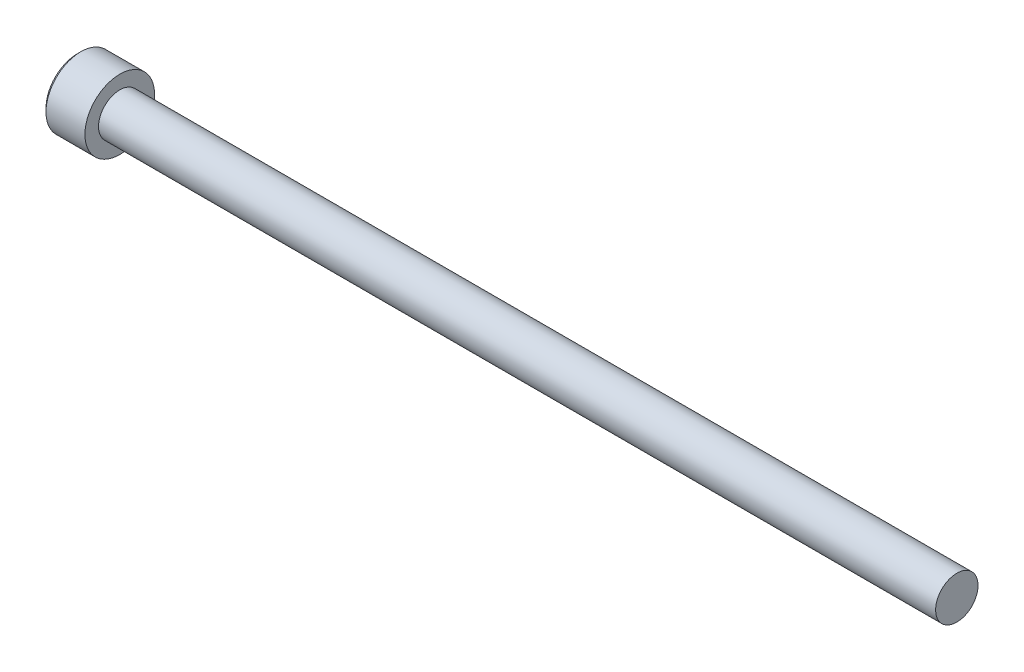
ISO-10303-21;
HEADER;
FILE_DESCRIPTION(('STEP AP214'),'2;1');
FILE_NAME('part.step','',(''),(''),'','','');
FILE_SCHEMA(('AUTOMOTIVE_DESIGN { 1 0 10303 214 1 1 1 1 }'));
ENDSEC;
DATA;
#1=APPLICATION_CONTEXT('core data for automotive mechanical design processes');
#2=APPLICATION_PROTOCOL_DEFINITION('international standard','automotive_design',2000,#1);
#3=PRODUCT_CONTEXT('',#1,'mechanical');
#4=PRODUCT('Part','Part','',(#3));
#5=PRODUCT_RELATED_PRODUCT_CATEGORY('part','',(#4));
#6=PRODUCT_DEFINITION_FORMATION('','',#4);
#7=PRODUCT_DEFINITION_CONTEXT('part definition',#1,'design');
#8=PRODUCT_DEFINITION('design','',#6,#7);
#9=PRODUCT_DEFINITION_SHAPE('','',#8);
#10=(LENGTH_UNIT() NAMED_UNIT(*) SI_UNIT(.MILLI.,.METRE.));
#11=(NAMED_UNIT(*) PLANE_ANGLE_UNIT() SI_UNIT($,.RADIAN.));
#12=(NAMED_UNIT(*) SI_UNIT($,.STERADIAN.) SOLID_ANGLE_UNIT());
#13=UNCERTAINTY_MEASURE_WITH_UNIT(LENGTH_MEASURE(1.E-05),#10,'distance_accuracy_value','');
#14=(GEOMETRIC_REPRESENTATION_CONTEXT(3) GLOBAL_UNCERTAINTY_ASSIGNED_CONTEXT((#13)) GLOBAL_UNIT_ASSIGNED_CONTEXT((#10,
#11,#12)) REPRESENTATION_CONTEXT('',''));
#15=CARTESIAN_POINT('',(0.,0.,0.));
#16=DIRECTION('',(0.,0.,1.));
#17=DIRECTION('',(1.,0.,0.));
#18=AXIS2_PLACEMENT_3D('',#15,#16,#17);
#19=CARTESIAN_POINT('',(-2.28600000000007,-1.14567944042317,1.984375));
#20=DIRECTION('',(0.,0.,1.));
#21=DIRECTION('',(1.,0.,0.));
#22=AXIS2_PLACEMENT_3D('',#19,#20,#21);
#23=PLANE('',#22);
#24=CARTESIAN_POINT('',(-4.82599999995852,1.14567944044653,1.98437499999554));
#25=CARTESIAN_POINT('',(-4.78691618362732,1.06743880343266,1.9843749999984));
#26=CARTESIAN_POINT('',(-4.75011447684892,0.987898318960917,1.98437499999957));
#27=CARTESIAN_POINT('',(-4.68265620500518,0.825677042028778,1.98437500000043));
#28=CARTESIAN_POINT('',(-4.65204056061138,0.742979382529199,1.98437500000012));
#29=CARTESIAN_POINT('',(-4.5991739228306,0.575193959555969,1.98437499999988));
#30=CARTESIAN_POINT('',(-4.57689462080725,0.490115359117279,1.98437499999997));
#31=CARTESIAN_POINT('',(-4.54259467221837,0.318093091130193,1.98437500000003));
#32=CARTESIAN_POINT('',(-4.5305423022885,0.231156054976726,1.984375));
#33=CARTESIAN_POINT('',(-4.52249110263747,0.119918521511051,1.984375));
#34=CARTESIAN_POINT('',(-4.52118947557477,0.0959468443046798,1.984375));
#35=CARTESIAN_POINT('',(-4.51945182629813,0.0479845644411998,1.984375));
#36=CARTESIAN_POINT('',(-4.51901533386223,0.0239939791589393,1.984375));
#37=CARTESIAN_POINT('',(-4.51901809008399,-0.0602201717457363,1.984375));
#38=CARTESIAN_POINT('',(-4.52177452299902,-0.120461721905447,1.984375));
#39=CARTESIAN_POINT('',(-4.5326365512493,-0.240474970989197,1.984375));
#40=CARTESIAN_POINT('',(-4.54074587749718,-0.300246312758427,1.984375));
#41=CARTESIAN_POINT('',(-4.57259622946939,-0.478763752804282,1.984375));
#42=CARTESIAN_POINT('',(-4.60385422611702,-0.596208828937734,1.984375));
#43=CARTESIAN_POINT('',(-4.66780003592237,-0.785921487441256,1.984375));
#44=CARTESIAN_POINT('',(-4.69623457768558,-0.859734609866899,1.984375));
#45=CARTESIAN_POINT('',(-4.75786140400812,-1.00456595519282,1.984375));
#46=CARTESIAN_POINT('',(-4.79100779300359,-1.07560356657101,1.984375));
#47=CARTESIAN_POINT('',(-4.82599999995643,-1.14567944044724,1.984375));
#48=B_SPLINE_CURVE_WITH_KNOTS('',3,(#24,#25,#26,#27,#28,#29,#30,#31,#32,#33,#34,#35,#36,#37,#38,
#39,#40,#41,#42,#43,#44,#45,#46,#47),.UNSPECIFIED.,.F.,.F.,(4,2,2,2,2,2,2,2,2,2,2,4),(0.,
0.262559005207405,0.526801735838036,0.790138824405318,1.05265603861765,1.12466619182083,
1.19663719499031,1.3772702672652,1.55802937209382,1.92104085090328,2.15819130092264,
2.39317265078575),.UNSPECIFIED.);
#49=CARTESIAN_POINT('',(-4.82599999996829,1.14567944041753,1.98437500003084));
#50=VERTEX_POINT('',#49);
#51=CARTESIAN_POINT('',(-4.8259999999622,-1.14567944043207,1.98437500001542));
#52=VERTEX_POINT('',#51);
#53=EDGE_CURVE('E20',#50,#52,#48,.T.);
#54=ORIENTED_EDGE('',*,*,#53,.F.);
#55=DIRECTION('',(1.,0.,0.));
#56=VECTOR('',#55,1.);
#57=CARTESIAN_POINT('',(-2.28600000000007,1.14567944042316,1.984375));
#58=LINE('',#57,#56);
#59=CARTESIAN_POINT('',(-2.28600000000007,1.14567944042316,1.984375));
#60=VERTEX_POINT('',#59);
#61=EDGE_CURVE('E68',#50,#60,#58,.T.);
#62=ORIENTED_EDGE('',*,*,#61,.T.);
#63=DIRECTION('',(0.,1.,0.));
#64=VECTOR('',#63,1.);
#65=CARTESIAN_POINT('',(-2.28600000000007,0.,1.984375));
#66=LINE('',#65,#64);
#67=CARTESIAN_POINT('',(-2.28600000000007,-1.14567944042317,1.984375));
#68=VERTEX_POINT('',#67);
#69=EDGE_CURVE('E74',#68,#60,#66,.T.);
#70=ORIENTED_EDGE('',*,*,#69,.F.);
#71=DIRECTION('',(1.,0.,0.));
#72=VECTOR('',#71,1.);
#73=CARTESIAN_POINT('',(-2.28600000000007,-1.14567944042317,1.984375));
#74=LINE('',#73,#72);
#75=EDGE_CURVE('E71',#68,#52,#74,.F.);
#76=ORIENTED_EDGE('',*,*,#75,.T.);
#77=EDGE_LOOP('',(#54,#62,#70,#76));
#78=FACE_BOUND('',#77,.T.);
#79=ADVANCED_FACE('F16',(#78),#23,.F.);
#80=CARTESIAN_POINT('',(-2.28600000000007,0.,0.));
#81=DIRECTION('',(-1.,0.,0.));
#82=DIRECTION('',(0.,0.,1.));
#83=AXIS2_PLACEMENT_3D('',#80,#81,#82);
#84=PLANE('',#83);
#85=DIRECTION('',(0.,0.5,0.866025403784439));
#86=VECTOR('',#85,1.);
#87=CARTESIAN_POINT('',(-2.28600000000007,2.29135888084633,0.));
#88=LINE('',#87,#86);
#89=CARTESIAN_POINT('',(-2.28600000000007,2.29135888084633,0.));
#90=VERTEX_POINT('',#89);
#91=CARTESIAN_POINT('',(-2.28600000000007,1.14567944042316,-1.984375));
#92=VERTEX_POINT('',#91);
#93=EDGE_CURVE('E82',#90,#92,#88,.F.);
#94=ORIENTED_EDGE('',*,*,#93,.T.);
#95=DIRECTION('',(0.,1.,0.));
#96=VECTOR('',#95,1.);
#97=CARTESIAN_POINT('',(-2.28600000000007,1.14567944042316,-1.984375));
#98=LINE('',#97,#96);
#99=CARTESIAN_POINT('',(-2.28600000000007,-1.14567944042316,-1.984375));
#100=VERTEX_POINT('',#99);
#101=EDGE_CURVE('E242',#92,#100,#98,.F.);
#102=ORIENTED_EDGE('',*,*,#101,.T.);
#103=DIRECTION('',(0.,0.5,-0.866025403784439));
#104=VECTOR('',#103,1.);
#105=CARTESIAN_POINT('',(-2.28600000000007,-1.14567944042316,-1.984375));
#106=LINE('',#105,#104);
#107=CARTESIAN_POINT('',(-2.28600000000007,-2.29135888084633,0.));
#108=VERTEX_POINT('',#107);
#109=EDGE_CURVE('E227',#100,#108,#106,.F.);
#110=ORIENTED_EDGE('',*,*,#109,.T.);
#111=DIRECTION('',(0.,-0.5,-0.866025403784439));
#112=VECTOR('',#111,1.);
#113=CARTESIAN_POINT('',(-2.28600000000007,-2.29135888084633,0.));
#114=LINE('',#113,#112);
#115=EDGE_CURVE('E224',#108,#68,#114,.F.);
#116=ORIENTED_EDGE('',*,*,#115,.T.);
#117=ORIENTED_EDGE('',*,*,#69,.T.);
#118=DIRECTION('',(0.,-0.5,0.866025403784439));
#119=VECTOR('',#118,1.);
#120=CARTESIAN_POINT('',(-2.28600000000007,1.14567944042316,1.984375));
#121=LINE('',#120,#119);
#122=EDGE_CURVE('E81',#60,#90,#121,.F.);
#123=ORIENTED_EDGE('',*,*,#122,.T.);
#124=EDGE_LOOP('',(#94,#102,#110,#116,#117,#123));
#125=FACE_BOUND('',#124,.T.);
#126=ADVANCED_FACE('F160',(#125),#84,.T.);
#127=CARTESIAN_POINT('',(-2.28600000000007,-1.14567944042316,-1.984375));
#128=DIRECTION('',(0.,-0.866025403784439,-0.5));
#129=DIRECTION('',(0.,0.5,-0.866025403784439));
#130=AXIS2_PLACEMENT_3D('',#127,#128,#129);
#131=PLANE('',#130);
#132=CARTESIAN_POINT('',(-4.82599999995871,-1.14567944040756,-1.98437500001887));
#133=CARTESIAN_POINT('',(-4.78666022792997,-1.18505700230148,-1.91617106214563));
#134=CARTESIAN_POINT('',(-4.74963132844072,-1.22509295783734,-1.8468267530301));
#135=CARTESIAN_POINT('',(-4.68183299424977,-1.30673037975396,-1.70542659047317));
#136=CARTESIAN_POINT('',(-4.65110127019237,-1.34833960561553,-1.63335729721673));
#137=CARTESIAN_POINT('',(-4.59845762010516,-1.432242568594,-1.48803310243203));
#138=CARTESIAN_POINT('',(-4.57641341195893,-1.47451494967301,-1.41481519064643));
#139=CARTESIAN_POINT('',(-4.54245011067441,-1.55999007976842,-1.26676792253773));
#140=CARTESIAN_POINT('',(-4.53050567471972,-1.6031902195197,-1.19194308559438));
#141=CARTESIAN_POINT('',(-4.51972842752365,-1.67764765054852,-1.06297903205139));
#142=CARTESIAN_POINT('',(-4.51813352794834,-1.70880881707173,-1.00900630841009));
#143=CARTESIAN_POINT('',(-4.52082392138599,-1.77108016542046,-0.901149169214274));
#144=CARTESIAN_POINT('',(-4.52511127545884,-1.80219032554946,-0.847264791239237));
#145=CARTESIAN_POINT('',(-4.53932219421538,-1.86411684097343,-0.740004920189235));
#146=CARTESIAN_POINT('',(-4.54925206045723,-1.8949328285454,-0.686630064029166));
#147=CARTESIAN_POINT('',(-4.5742029484467,-1.95603190279815,-0.580803363127978));
#148=CARTESIAN_POINT('',(-4.58922357974385,-1.98631503016081,-0.528351447923769));
#149=CARTESIAN_POINT('',(-4.63380478900425,-2.06386502548479,-0.394030915895904));
#150=CARTESIAN_POINT('',(-4.66672213384104,-2.11065153226583,-0.312994309042484));
#151=CARTESIAN_POINT('',(-4.72228952038986,-2.17944749410732,-0.193836207777459));
#152=CARTESIAN_POINT('',(-4.74181309375939,-2.20211890802843,-0.154568166986659));
#153=CARTESIAN_POINT('',(-4.78263970065987,-2.24704195201531,-0.0767591723707469));
#154=CARTESIAN_POINT('',(-4.80394164363173,-2.2692938292399,-0.0382177904539708));
#155=CARTESIAN_POINT('',(-4.82599999995675,-2.29135888085868,2.13931096265935E-11));
#156=B_SPLINE_CURVE_WITH_KNOTS('',3,(#132,#133,#134,#135,#136,#137,#138,#139,#140,#141,#142,
#143,#144,#145,#146,#147,#148,#149,#150,#151,#152,#153,#154,#155),.UNSPECIFIED.,.F.,.F.,(4,2,2,
2,2,2,2,2,2,2,2,4),(0.,0.264284909626495,0.530108996358094,0.791712695414128,1.05265800174404,
1.23942150116703,1.42625045663858,1.61328847394198,1.80031214908683,2.09727151182814,
2.24534838946042,2.39333511890876),.UNSPECIFIED.);
#157=CARTESIAN_POINT('',(-4.8259999999622,-1.14567944043207,-1.98437500001542));
#158=VERTEX_POINT('',#157);
#159=CARTESIAN_POINT('',(-4.82599999996846,-2.2913588808704,-2.00043543490866E-11));
#160=VERTEX_POINT('',#159);
#161=EDGE_CURVE('E162',#158,#160,#156,.T.);
#162=ORIENTED_EDGE('',*,*,#161,.T.);
#163=DIRECTION('',(1.,0.,0.));
#164=VECTOR('',#163,1.);
#165=CARTESIAN_POINT('',(-2.28600000000007,-2.29135888084633,0.));
#166=LINE('',#165,#164);
#167=EDGE_CURVE('E235',#160,#108,#166,.T.);
#168=ORIENTED_EDGE('',*,*,#167,.T.);
#169=ORIENTED_EDGE('',*,*,#109,.F.);
#170=DIRECTION('',(-1.,0.,0.));
#171=VECTOR('',#170,1.);
#172=CARTESIAN_POINT('',(-2.28600000000007,-1.14567944042316,-1.984375));
#173=LINE('',#172,#171);
#174=EDGE_CURVE('E245',#100,#158,#173,.T.);
#175=ORIENTED_EDGE('',*,*,#174,.T.);
#176=EDGE_LOOP('',(#162,#168,#169,#175));
#177=FACE_BOUND('',#176,.T.);
#178=ADVANCED_FACE('F156',(#177),#131,.F.);
#179=CARTESIAN_POINT('',(-2.28600000000007,-2.29135888084633,0.));
#180=DIRECTION('',(0.,-0.866025403784439,0.5));
#181=DIRECTION('',(0.,-0.5,-0.866025403784439));
#182=AXIS2_PLACEMENT_3D('',#179,#180,#181);
#183=PLANE('',#182);
#184=CARTESIAN_POINT('',(-4.8259999999587,-2.29135888085486,-2.29477011545215E-11));
#185=CARTESIAN_POINT('',(-4.78666022792997,-2.25198131896546,0.0682039378529047));
#186=CARTESIAN_POINT('',(-4.74963132844072,-2.21194536343147,0.137548246969502));
#187=CARTESIAN_POINT('',(-4.68183299424977,-2.13030794151622,0.278948409527228));
#188=CARTESIAN_POINT('',(-4.65110127019237,-2.08869871565414,0.351017702783377));
#189=CARTESIAN_POINT('',(-4.59845762010516,-2.00479575267531,0.496341897567867));
#190=CARTESIAN_POINT('',(-4.57641341195893,-1.96252337159644,0.569559809353539));
#191=CARTESIAN_POINT('',(-4.5424501106744,-1.87704824150112,0.717607077462299));
#192=CARTESIAN_POINT('',(-4.53050567471972,-1.8338481017498,0.792431914405622));
#193=CARTESIAN_POINT('',(-4.51972842752365,-1.75939067072096,0.921395967948603));
#194=CARTESIAN_POINT('',(-4.51813352794834,-1.72822950419776,0.975368691589913));
#195=CARTESIAN_POINT('',(-4.52082392138599,-1.66595815584903,1.08322583078573));
#196=CARTESIAN_POINT('',(-4.52511127545884,-1.63484799572003,1.13711020876076));
#197=CARTESIAN_POINT('',(-4.53932219421538,-1.57292148029607,1.24437007981077));
#198=CARTESIAN_POINT('',(-4.54925206045723,-1.54210549272409,1.29774493597084));
#199=CARTESIAN_POINT('',(-4.5742029484467,-1.48100641847134,1.40357163687202));
#200=CARTESIAN_POINT('',(-4.58922357974385,-1.45072329110868,1.45602355207623));
#201=CARTESIAN_POINT('',(-4.63380478900421,-1.37317329578476,1.59034408410398));
#202=CARTESIAN_POINT('',(-4.66672213384095,-1.32638678900379,1.6713806909573));
#203=CARTESIAN_POINT('',(-4.72228952038968,-1.25759082716239,1.79053879222216));
#204=CARTESIAN_POINT('',(-4.74181309375917,-1.23491941324131,1.82980683301291));
#205=CARTESIAN_POINT('',(-4.78263970065959,-1.18999636925449,1.90761582762873));
#206=CARTESIAN_POINT('',(-4.8039416436314,-1.16774449202993,1.94615720954545));
#207=CARTESIAN_POINT('',(-4.82599999995639,-1.14567944041117,1.98437500002077));
#208=B_SPLINE_CURVE_WITH_KNOTS('',3,(#184,#185,#186,#187,#188,#189,#190,#191,#192,#193,#194,
#195,#196,#197,#198,#199,#200,#201,#202,#203,#204,#205,#206,#207),.UNSPECIFIED.,.F.,.F.,(4,2,2,
2,2,2,2,2,2,2,2,4),(0.,0.264284909626493,0.530108996358089,0.791712695414125,1.05265800174404,
1.23942150116703,1.42625045663858,1.61328847394198,1.80031214908683,2.09727151182773,
2.24534838945981,2.39333511890795),.UNSPECIFIED.);
#209=EDGE_CURVE('E91',#160,#52,#208,.T.);
#210=ORIENTED_EDGE('',*,*,#209,.T.);
#211=ORIENTED_EDGE('',*,*,#75,.F.);
#212=ORIENTED_EDGE('',*,*,#115,.F.);
#213=ORIENTED_EDGE('',*,*,#167,.F.);
#214=EDGE_LOOP('',(#210,#211,#212,#213));
#215=FACE_BOUND('',#214,.T.);
#216=ADVANCED_FACE('F151',(#215),#183,.F.);
#217=CARTESIAN_POINT('',(-2.28600000000007,1.14567944042316,1.984375));
#218=DIRECTION('',(0.,0.866025403784439,0.5));
#219=DIRECTION('',(0.,-0.5,0.866025403784439));
#220=AXIS2_PLACEMENT_3D('',#217,#218,#219);
#221=PLANE('',#220);
#222=CARTESIAN_POINT('',(-4.82599999995852,1.14567944040762,1.98437500001801));
#223=CARTESIAN_POINT('',(-4.78666022792973,1.1850570023017,1.91617106214498));
#224=CARTESIAN_POINT('',(-4.74963132844047,1.22509295783761,1.84682675302957));
#225=CARTESIAN_POINT('',(-4.68183299424957,1.30673037975422,1.70542659047278));
#226=CARTESIAN_POINT('',(-4.65110127019222,1.34833960561574,1.63335729721638));
#227=CARTESIAN_POINT('',(-4.59845762010509,1.43224256859413,1.48803310243178));
#228=CARTESIAN_POINT('',(-4.57641341195888,1.47451494967311,1.41481519064625));
#229=CARTESIAN_POINT('',(-4.54245011067439,1.55999007976846,1.26676792253767));
#230=CARTESIAN_POINT('',(-4.53050567471972,1.6031902195197,1.19194308559439));
#231=CARTESIAN_POINT('',(-4.51972842752365,1.67764765054848,1.06297903205146));
#232=CARTESIAN_POINT('',(-4.51813352794835,1.70880881707169,1.00900630841016));
#233=CARTESIAN_POINT('',(-4.52082392138598,1.77108016542041,0.901149169214364));
#234=CARTESIAN_POINT('',(-4.52511127545883,1.80219032554941,0.847264791239333));
#235=CARTESIAN_POINT('',(-4.53932219421536,1.86411684097336,0.740004920189342));
#236=CARTESIAN_POINT('',(-4.54925206045721,1.89493282854533,0.686630064029278));
#237=CARTESIAN_POINT('',(-4.57420294844667,1.95603190279808,0.5808033631281));
#238=CARTESIAN_POINT('',(-4.58922357974382,1.98631503016074,0.528351447923897));
#239=CARTESIAN_POINT('',(-4.6338047890042,2.06386502548473,0.394030915896012));
#240=CARTESIAN_POINT('',(-4.666722133841,2.11065153226578,0.312994309042568));
#241=CARTESIAN_POINT('',(-4.72228952038984,2.17944749410729,0.19383620777751));
#242=CARTESIAN_POINT('',(-4.74181309375937,2.20211890802841,0.1545681669867));
#243=CARTESIAN_POINT('',(-4.78263970065986,2.24704195201529,0.0767591723707674));
#244=CARTESIAN_POINT('',(-4.80394164363172,2.26929382923989,0.0382177904539813));
#245=CARTESIAN_POINT('',(-4.82599999995675,2.29135888085868,-2.1392886942985E-11));
#246=B_SPLINE_CURVE_WITH_KNOTS('',3,(#222,#223,#224,#225,#226,#227,#228,#229,#230,#231,#232,
#233,#234,#235,#236,#237,#238,#239,#240,#241,#242,#243,#244,#245),.UNSPECIFIED.,.F.,.F.,(4,2,2,
2,2,2,2,2,2,2,2,4),(0.,0.26428490962629,0.530108996357672,0.791712695413487,1.05265800174319,
1.23942150116616,1.42625045663768,1.61328847394106,1.80031214908589,2.09727151182728,
2.2453483894596,2.39333511890798),.UNSPECIFIED.);
#247=CARTESIAN_POINT('',(-4.82599999996846,2.29135888087039,2.00042061038936E-11));
#248=VERTEX_POINT('',#247);
#249=EDGE_CURVE('E79',#50,#248,#246,.T.);
#250=ORIENTED_EDGE('',*,*,#249,.T.);
#251=DIRECTION('',(1.,0.,0.));
#252=VECTOR('',#251,1.);
#253=CARTESIAN_POINT('',(-2.28600000000007,2.29135888084633,0.));
#254=LINE('',#253,#252);
#255=EDGE_CURVE('E246',#248,#90,#254,.T.);
#256=ORIENTED_EDGE('',*,*,#255,.T.);
#257=ORIENTED_EDGE('',*,*,#122,.F.);
#258=ORIENTED_EDGE('',*,*,#61,.F.);
#259=EDGE_LOOP('',(#250,#256,#257,#258));
#260=FACE_BOUND('',#259,.T.);
#261=ADVANCED_FACE('F76',(#260),#221,.F.);
#262=CARTESIAN_POINT('',(-2.28600000000007,2.29135888084633,0.));
#263=DIRECTION('',(0.,0.866025403784439,-0.5));
#264=DIRECTION('',(0.,0.5,0.866025403784439));
#265=AXIS2_PLACEMENT_3D('',#262,#263,#264);
#266=PLANE('',#265);
#267=CARTESIAN_POINT('',(-4.82599999995871,2.29135888085486,2.29489280696874E-11));
#268=CARTESIAN_POINT('',(-4.78666022792997,2.25198131896547,-0.0682039378529039));
#269=CARTESIAN_POINT('',(-4.74963132844072,2.21194536343147,-0.137548246969502));
#270=CARTESIAN_POINT('',(-4.68183299424977,2.13030794151622,-0.278948409527229));
#271=CARTESIAN_POINT('',(-4.65110127019237,2.08869871565414,-0.351017702783379));
#272=CARTESIAN_POINT('',(-4.59845762010516,2.00479575267531,-0.496341897567869));
#273=CARTESIAN_POINT('',(-4.57641341195893,1.96252337159644,-0.569559809353541));
#274=CARTESIAN_POINT('',(-4.5424501106744,1.87704824150112,-0.7176070774623));
#275=CARTESIAN_POINT('',(-4.53050567471972,1.8338481017498,-0.792431914405622));
#276=CARTESIAN_POINT('',(-4.51972842752365,1.75939067072096,-0.921395967948603));
#277=CARTESIAN_POINT('',(-4.51813352794834,1.72822950419776,-0.975368691589912));
#278=CARTESIAN_POINT('',(-4.52082392138599,1.66595815584903,-1.08322583078573));
#279=CARTESIAN_POINT('',(-4.52511127545884,1.63484799572003,-1.13711020876076));
#280=CARTESIAN_POINT('',(-4.53932219421538,1.57292148029607,-1.24437007981077));
#281=CARTESIAN_POINT('',(-4.54925206045723,1.54210549272409,-1.29774493597083));
#282=CARTESIAN_POINT('',(-4.5742029484467,1.48100641847134,-1.40357163687202));
#283=CARTESIAN_POINT('',(-4.58922357974385,1.45072329110868,-1.45602355207623));
#284=CARTESIAN_POINT('',(-4.63380478900425,1.3731732957847,-1.5903440841041));
#285=CARTESIAN_POINT('',(-4.66672213384104,1.32638678900366,-1.67138069095752));
#286=CARTESIAN_POINT('',(-4.72228952038986,1.25759082716218,-1.79053879222254));
#287=CARTESIAN_POINT('',(-4.74181309375939,1.23491941324106,-1.82980683301334));
#288=CARTESIAN_POINT('',(-4.78263970065987,1.18999636925419,-1.90761582762925));
#289=CARTESIAN_POINT('',(-4.80394164363173,1.1677444920296,-1.94615720954603));
#290=CARTESIAN_POINT('',(-4.82599999995675,1.14567944041081,-1.98437500002139));
#291=B_SPLINE_CURVE_WITH_KNOTS('',3,(#267,#268,#269,#270,#271,#272,#273,#274,#275,#276,#277,
#278,#279,#280,#281,#282,#283,#284,#285,#286,#287,#288,#289,#290),.UNSPECIFIED.,.F.,.F.,(4,2,2,
2,2,2,2,2,2,2,2,4),(0.,0.264284909626495,0.530108996358093,0.791712695414127,1.05265800174404,
1.23942150116703,1.42625045663858,1.61328847394198,1.80031214908683,2.09727151182814,
2.24534838946042,2.39333511890876),.UNSPECIFIED.);
#292=CARTESIAN_POINT('',(-4.82599999996846,1.14567944045252,-1.98437500001084));
#293=VERTEX_POINT('',#292);
#294=EDGE_CURVE('E39',#248,#293,#291,.T.);
#295=ORIENTED_EDGE('',*,*,#294,.T.);
#296=DIRECTION('',(-1.,0.,0.));
#297=VECTOR('',#296,1.);
#298=CARTESIAN_POINT('',(-2.28600000000007,1.14567944042316,-1.984375));
#299=LINE('',#298,#297);
#300=EDGE_CURVE('E166',#293,#92,#299,.F.);
#301=ORIENTED_EDGE('',*,*,#300,.T.);
#302=ORIENTED_EDGE('',*,*,#93,.F.);
#303=ORIENTED_EDGE('',*,*,#255,.F.);
#304=EDGE_LOOP('',(#295,#301,#302,#303));
#305=FACE_BOUND('',#304,.T.);
#306=ADVANCED_FACE('F150',(#305),#266,.F.);
#307=CARTESIAN_POINT('',(-2.28600000000007,1.14567944042316,-1.984375));
#308=DIRECTION('',(0.,0.,-1.));
#309=DIRECTION('',(-1.,0.,0.));
#310=AXIS2_PLACEMENT_3D('',#307,#308,#309);
#311=PLANE('',#310);
#312=CARTESIAN_POINT('',(-4.8259999999587,1.14567944044731,-1.98437499999592));
#313=CARTESIAN_POINT('',(-4.78666022793094,1.06692431665146,-1.98437499999853));
#314=CARTESIAN_POINT('',(-4.74963132844318,0.986852405569011,-1.98437499999961));
#315=CARTESIAN_POINT('',(-4.6818329942566,0.823577561711963,-1.9843750000004));
#316=CARTESIAN_POINT('',(-4.65110127020207,0.740359109975722,-1.98437500000011));
#317=CARTESIAN_POINT('',(-4.59845762012233,0.572553183993917,-1.9843749999999));
#318=CARTESIAN_POINT('',(-4.57641341198063,0.488008421824127,-1.98437499999997));
#319=CARTESIAN_POINT('',(-4.54245011070673,0.317058161610178,-1.98437500000003));
#320=CARTESIAN_POINT('',(-4.53050567475816,0.230657882096267,-1.98437500000001));
#321=CARTESIAN_POINT('',(-4.51972842757294,0.0817430200124032,-1.984375));
#322=CARTESIAN_POINT('',(-4.51813352800283,0.0194206869508218,-1.984375));
#323=CARTESIAN_POINT('',(-4.52082392145254,-0.1051220097764,-1.984375));
#324=CARTESIAN_POINT('',(-4.52511127553227,-0.167342330049008,-1.984375));
#325=CARTESIAN_POINT('',(-4.53932219430377,-0.291195360925477,-1.984375));
#326=CARTESIAN_POINT('',(-4.54925206055372,-0.352827336083362,-1.984375));
#327=CARTESIAN_POINT('',(-4.57420294856008,-0.475025484616114,-1.984375));
#328=CARTESIAN_POINT('',(-4.58922357986604,-0.535591739354747,-1.984375));
#329=CARTESIAN_POINT('',(-4.63380478912724,-0.690691729958653,-1.984375));
#330=CARTESIAN_POINT('',(-4.66672213394715,-0.784264743465576,-1.984375));
#331=CARTESIAN_POINT('',(-4.7222895204619,-0.921856667069616,-1.984375));
#332=CARTESIAN_POINT('',(-4.74181309381856,-0.967199494886089,-1.984375));
#333=CARTESIAN_POINT('',(-4.78263970069104,-1.05704558280959,-1.984375));
#334=CARTESIAN_POINT('',(-4.80394164364776,-1.10154933723428,-1.984375));
#335=CARTESIAN_POINT('',(-4.82599999995675,-1.14567944044787,-1.984375));
#336=B_SPLINE_CURVE_WITH_KNOTS('',3,(#312,#313,#314,#315,#316,#317,#318,#319,#320,#321,#322,
#323,#324,#325,#326,#327,#328,#329,#330,#331,#332,#333,#334,#335),.UNSPECIFIED.,.F.,.F.,(4,2,2,
2,2,2,2,2,2,2,2,4),(0.,0.264284909658836,0.530108996422784,0.791712695509868,1.0526580018708,
1.23942150133878,1.42625045685537,1.61328847420389,1.80031214939384,2.09727151196384,
2.24534838950992,2.39333511887245),.UNSPECIFIED.);
#337=EDGE_CURVE('E108',#293,#158,#336,.T.);
#338=ORIENTED_EDGE('',*,*,#337,.T.);
#339=ORIENTED_EDGE('',*,*,#174,.F.);
#340=ORIENTED_EDGE('',*,*,#101,.F.);
#341=ORIENTED_EDGE('',*,*,#300,.F.);
#342=EDGE_LOOP('',(#338,#339,#340,#341));
#343=FACE_BOUND('',#342,.T.);
#344=ADVANCED_FACE('F121',(#343),#311,.F.);
#345=CARTESIAN_POINT('',(-4.82599999998001,0.,0.));
#346=DIRECTION('',(-1.,0.,0.));
#347=DIRECTION('',(0.,0.,1.));
#348=AXIS2_PLACEMENT_3D('',#345,#346,#347);
#349=CONICAL_SURFACE('',#348,2.29135888088194,0.785398163397448);
#350=ORIENTED_EDGE('',*,*,#161,.F.);
#351=CARTESIAN_POINT('',(-4.82599999998001,0.,0.));
#352=DIRECTION('',(-1.,0.,0.));
#353=DIRECTION('',(0.,0.,1.));
#354=AXIS2_PLACEMENT_3D('',#351,#352,#353);
#355=CIRCLE('',#354,2.29135888088194);
#356=EDGE_CURVE('E105',#158,#160,#355,.T.);
#357=ORIENTED_EDGE('',*,*,#356,.T.);
#358=EDGE_LOOP('',(#350,#357));
#359=FACE_BOUND('',#358,.T.);
#360=ADVANCED_FACE('F167',(#359),#349,.F.);
#361=CARTESIAN_POINT('',(-4.82599999998001,0.,0.));
#362=DIRECTION('',(-1.,0.,0.));
#363=DIRECTION('',(0.,0.,1.));
#364=AXIS2_PLACEMENT_3D('',#361,#362,#363);
#365=CONICAL_SURFACE('',#364,2.29135888088194,0.785398163397448);
#366=ORIENTED_EDGE('',*,*,#209,.F.);
#367=CARTESIAN_POINT('',(-4.82599999998001,0.,0.));
#368=DIRECTION('',(-1.,0.,0.));
#369=DIRECTION('',(0.,0.,1.));
#370=AXIS2_PLACEMENT_3D('',#367,#368,#369);
#371=CIRCLE('',#370,2.29135888088194);
#372=EDGE_CURVE('E86',#160,#52,#371,.T.);
#373=ORIENTED_EDGE('',*,*,#372,.T.);
#374=EDGE_LOOP('',(#366,#373));
#375=FACE_BOUND('',#374,.T.);
#376=ADVANCED_FACE('F170',(#375),#365,.F.);
#377=CARTESIAN_POINT('',(-4.82599999998001,0.,0.));
#378=DIRECTION('',(-1.,0.,0.));
#379=DIRECTION('',(0.,0.,1.));
#380=AXIS2_PLACEMENT_3D('',#377,#378,#379);
#381=CONICAL_SURFACE('',#380,2.29135888088194,0.78539816348948);
#382=CARTESIAN_POINT('',(-4.82599999998001,0.,0.));
#383=DIRECTION('',(-1.,0.,0.));
#384=DIRECTION('',(0.,0.,1.));
#385=AXIS2_PLACEMENT_3D('',#382,#383,#384);
#386=CIRCLE('',#385,2.29135888088194);
#387=EDGE_CURVE('E59',#52,#50,#386,.T.);
#388=ORIENTED_EDGE('',*,*,#387,.T.);
#389=ORIENTED_EDGE('',*,*,#53,.T.);
#390=EDGE_LOOP('',(#388,#389));
#391=FACE_BOUND('',#390,.T.);
#392=ADVANCED_FACE('F84',(#391),#381,.F.);
#393=CARTESIAN_POINT('',(-4.82599999998001,0.,0.));
#394=DIRECTION('',(-1.,0.,0.));
#395=DIRECTION('',(0.,0.,1.));
#396=AXIS2_PLACEMENT_3D('',#393,#394,#395);
#397=CONICAL_SURFACE('',#396,2.29135888088194,0.785398163397448);
#398=ORIENTED_EDGE('',*,*,#249,.F.);
#399=CARTESIAN_POINT('',(-4.82599999998001,0.,0.));
#400=DIRECTION('',(-1.,0.,0.));
#401=DIRECTION('',(0.,0.,1.));
#402=AXIS2_PLACEMENT_3D('',#399,#400,#401);
#403=CIRCLE('',#402,2.29135888088194);
#404=EDGE_CURVE('E85',#50,#248,#403,.T.);
#405=ORIENTED_EDGE('',*,*,#404,.T.);
#406=EDGE_LOOP('',(#398,#405));
#407=FACE_BOUND('',#406,.T.);
#408=ADVANCED_FACE('F90',(#407),#397,.F.);
#409=CARTESIAN_POINT('',(-4.82599999998001,0.,0.));
#410=DIRECTION('',(-1.,0.,0.));
#411=DIRECTION('',(0.,0.,1.));
#412=AXIS2_PLACEMENT_3D('',#409,#410,#411);
#413=CONICAL_SURFACE('',#412,2.29135888088194,0.785398163397448);
#414=ORIENTED_EDGE('',*,*,#294,.F.);
#415=CARTESIAN_POINT('',(-4.82599999998001,0.,0.));
#416=DIRECTION('',(-1.,0.,0.));
#417=DIRECTION('',(0.,0.,1.));
#418=AXIS2_PLACEMENT_3D('',#415,#416,#417);
#419=CIRCLE('',#418,2.29135888088194);
#420=EDGE_CURVE('E97',#248,#293,#419,.T.);
#421=ORIENTED_EDGE('',*,*,#420,.T.);
#422=EDGE_LOOP('',(#414,#421));
#423=FACE_BOUND('',#422,.T.);
#424=ADVANCED_FACE('F128',(#423),#413,.F.);
#425=CARTESIAN_POINT('',(-4.82599999998001,0.,0.));
#426=DIRECTION('',(-1.,0.,0.));
#427=DIRECTION('',(0.,0.,1.));
#428=AXIS2_PLACEMENT_3D('',#425,#426,#427);
#429=CONICAL_SURFACE('',#428,2.29135888088194,0.785398163489476);
#430=ORIENTED_EDGE('',*,*,#337,.F.);
#431=CARTESIAN_POINT('',(-4.82599999998001,0.,0.));
#432=DIRECTION('',(-1.,0.,0.));
#433=DIRECTION('',(0.,0.,1.));
#434=AXIS2_PLACEMENT_3D('',#431,#432,#433);
#435=CIRCLE('',#434,2.29135888088194);
#436=EDGE_CURVE('E99',#293,#158,#435,.T.);
#437=ORIENTED_EDGE('',*,*,#436,.T.);
#438=EDGE_LOOP('',(#430,#437));
#439=FACE_BOUND('',#438,.T.);
#440=ADVANCED_FACE('F124',(#439),#429,.F.);
#441=CARTESIAN_POINT('',(-4.82600000000007,0.,0.));
#442=DIRECTION('',(1.,0.,0.));
#443=DIRECTION('',(0.,0.,-1.));
#444=AXIS2_PLACEMENT_3D('',#441,#442,#443);
#445=PLANE('',#444);
#446=CARTESIAN_POINT('',(-4.82599999998001,0.,0.));
#447=DIRECTION('',(1.,0.,0.));
#448=DIRECTION('',(0.,0.,-1.));
#449=AXIS2_PLACEMENT_3D('',#446,#447,#448);
#450=CIRCLE('',#449,3.56615999999121);
#451=CARTESIAN_POINT('',(-4.82599999998001,0.,-3.56615999999121));
#452=VERTEX_POINT('',#451);
#453=EDGE_CURVE('E212',#452,#452,#450,.T.);
#454=ORIENTED_EDGE('',*,*,#453,.F.);
#455=EDGE_LOOP('',(#454));
#456=FACE_BOUND('',#455,.T.);
#457=ORIENTED_EDGE('',*,*,#420,.F.);
#458=ORIENTED_EDGE('',*,*,#404,.F.);
#459=ORIENTED_EDGE('',*,*,#387,.F.);
#460=ORIENTED_EDGE('',*,*,#372,.F.);
#461=ORIENTED_EDGE('',*,*,#356,.F.);
#462=ORIENTED_EDGE('',*,*,#436,.F.);
#463=EDGE_LOOP('',(#457,#458,#459,#460,#461,#462));
#464=FACE_BOUND('',#463,.T.);
#465=ADVANCED_FACE('F94',(#456,#464),#445,.F.);
#466=CARTESIAN_POINT('',(-4.42976000010731,0.,0.));
#467=DIRECTION('',(1.,0.,0.));
#468=DIRECTION('',(0.,0.,-1.));
#469=AXIS2_PLACEMENT_3D('',#466,#467,#468);
#470=CONICAL_SURFACE('',#469,3.96239999986392,0.785398163397448);
#471=CARTESIAN_POINT('',(-4.42976000000007,0.,0.));
#472=DIRECTION('',(-1.,0.,0.));
#473=DIRECTION('',(0.,0.,1.));
#474=AXIS2_PLACEMENT_3D('',#471,#472,#473);
#475=CIRCLE('',#474,3.9624);
#476=CARTESIAN_POINT('',(-4.42976000000007,0.,3.9624));
#477=VERTEX_POINT('',#476);
#478=EDGE_CURVE('E209',#477,#477,#475,.F.);
#479=ORIENTED_EDGE('',*,*,#478,.F.);
#480=EDGE_LOOP('',(#479));
#481=FACE_BOUND('',#480,.T.);
#482=ORIENTED_EDGE('',*,*,#453,.T.);
#483=EDGE_LOOP('',(#482));
#484=FACE_BOUND('',#483,.T.);
#485=ADVANCED_FACE('F198',(#481,#484),#470,.T.);
#486=CARTESIAN_POINT('',(-4.82600000000008,0.,0.));
#487=DIRECTION('',(-1.,0.,0.));
#488=DIRECTION('',(0.,0.,1.));
#489=AXIS2_PLACEMENT_3D('',#486,#487,#488);
#490=CYLINDRICAL_SURFACE('',#489,3.9624);
#491=ORIENTED_EDGE('',*,*,#478,.T.);
#492=EDGE_LOOP('',(#491));
#493=FACE_BOUND('',#492,.T.);
#494=CARTESIAN_POINT('',(0.,0.,0.));
#495=DIRECTION('',(-1.,0.,0.));
#496=DIRECTION('',(0.,0.,1.));
#497=AXIS2_PLACEMENT_3D('',#494,#495,#496);
#498=CIRCLE('',#497,3.9624);
#499=CARTESIAN_POINT('',(0.,0.,3.9624));
#500=VERTEX_POINT('',#499);
#501=EDGE_CURVE('E214',#500,#500,#498,.T.);
#502=ORIENTED_EDGE('',*,*,#501,.T.);
#503=EDGE_LOOP('',(#502));
#504=FACE_BOUND('',#503,.T.);
#505=ADVANCED_FACE('F195',(#493,#504),#490,.T.);
#506=CARTESIAN_POINT('',(95.25,0.,0.));
#507=DIRECTION('',(1.,0.,0.));
#508=DIRECTION('',(0.,0.,-1.));
#509=AXIS2_PLACEMENT_3D('',#506,#507,#508);
#510=PLANE('',#509);
#511=CARTESIAN_POINT('',(95.25,0.,0.));
#512=DIRECTION('',(-1.,0.,0.));
#513=DIRECTION('',(0.,0.,1.));
#514=AXIS2_PLACEMENT_3D('',#511,#512,#513);
#515=CIRCLE('',#514,2.413);
#516=CARTESIAN_POINT('',(95.25,0.,2.413));
#517=VERTEX_POINT('',#516);
#518=EDGE_CURVE('E30',#517,#517,#515,.T.);
#519=ORIENTED_EDGE('',*,*,#518,.F.);
#520=EDGE_LOOP('',(#519));
#521=FACE_BOUND('',#520,.T.);
#522=ADVANCED_FACE('F188',(#521),#510,.T.);
#523=CARTESIAN_POINT('',(0.,3.9624,0.));
#524=DIRECTION('',(-1.,0.,0.));
#525=DIRECTION('',(0.,0.,1.));
#526=AXIS2_PLACEMENT_3D('',#523,#524,#525);
#527=PLANE('',#526);
#528=CARTESIAN_POINT('',(0.,0.,0.));
#529=DIRECTION('',(-1.,0.,0.));
#530=DIRECTION('',(0.,0.,1.));
#531=AXIS2_PLACEMENT_3D('',#528,#529,#530);
#532=CIRCLE('',#531,2.413);
#533=CARTESIAN_POINT('',(0.,0.,2.413));
#534=VERTEX_POINT('',#533);
#535=EDGE_CURVE('E11',#534,#534,#532,.F.);
#536=ORIENTED_EDGE('',*,*,#535,.F.);
#537=EDGE_LOOP('',(#536));
#538=FACE_BOUND('',#537,.T.);
#539=ORIENTED_EDGE('',*,*,#501,.F.);
#540=EDGE_LOOP('',(#539));
#541=FACE_BOUND('',#540,.T.);
#542=ADVANCED_FACE('F182',(#538,#541),#527,.F.);
#543=CARTESIAN_POINT('',(95.25,0.,0.));
#544=DIRECTION('',(-1.,0.,0.));
#545=DIRECTION('',(0.,0.,1.));
#546=AXIS2_PLACEMENT_3D('',#543,#544,#545);
#547=CYLINDRICAL_SURFACE('',#546,2.413);
#548=ORIENTED_EDGE('',*,*,#535,.T.);
#549=EDGE_LOOP('',(#548));
#550=FACE_BOUND('',#549,.T.);
#551=ORIENTED_EDGE('',*,*,#518,.T.);
#552=EDGE_LOOP('',(#551));
#553=FACE_BOUND('',#552,.T.);
#554=ADVANCED_FACE('F180',(#550,#553),#547,.T.);
#555=CLOSED_SHELL('',(#79,#126,#178,#216,#261,#306,#344,#360,#376,#392,#408,#424,#440,#465,#485,
#505,#522,#542,#554));
#556=MANIFOLD_SOLID_BREP('B1',#555);
#557=ADVANCED_BREP_SHAPE_REPRESENTATION('',(#18,#556),#14);
#558=SHAPE_DEFINITION_REPRESENTATION(#9,#557);
ENDSEC;
END-ISO-10303-21;
